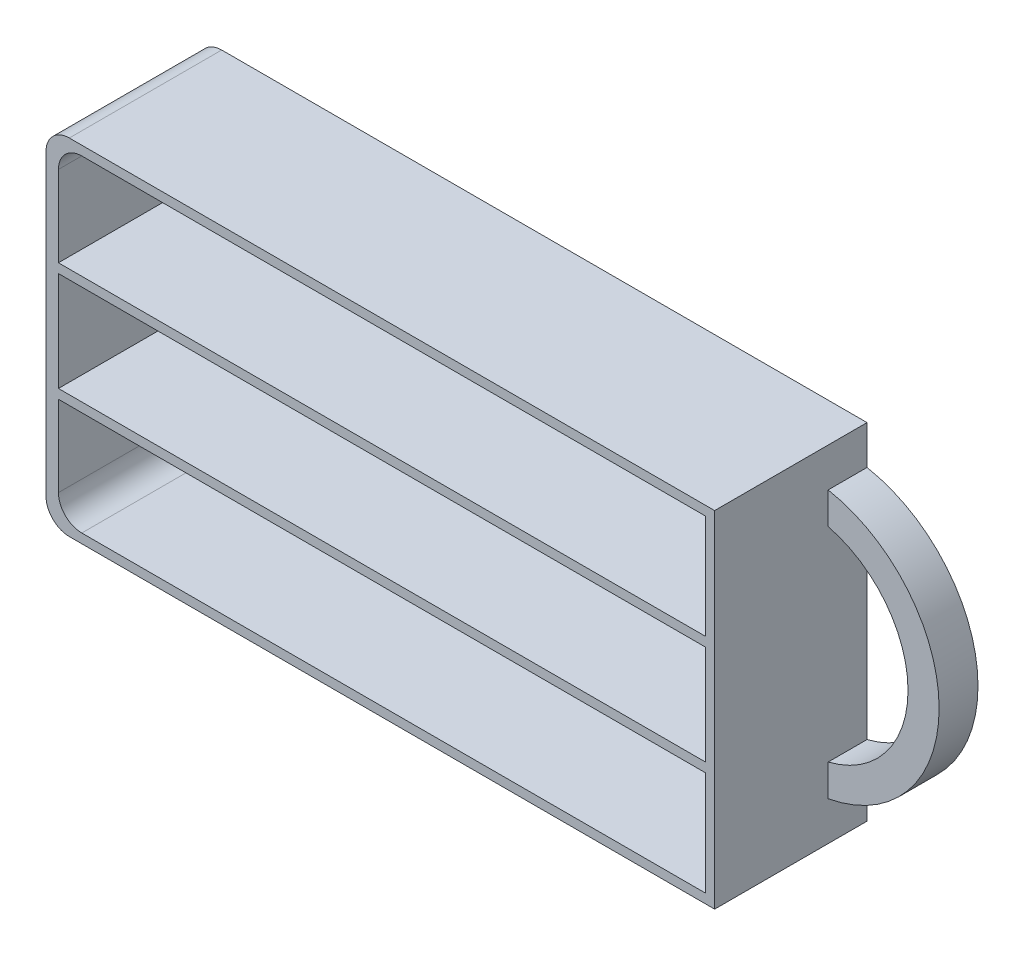
ISO-10303-21;
HEADER;
FILE_DESCRIPTION(('STEP AP214'),'2;1');
FILE_NAME('part.step','',(''),(''),'','','');
FILE_SCHEMA(('AUTOMOTIVE_DESIGN { 1 0 10303 214 1 1 1 1 }'));
ENDSEC;
DATA;
#1=APPLICATION_CONTEXT('core data for automotive mechanical design processes');
#2=APPLICATION_PROTOCOL_DEFINITION('international standard','automotive_design',2000,#1);
#3=PRODUCT_CONTEXT('',#1,'mechanical');
#4=PRODUCT('Part','Part','',(#3));
#5=PRODUCT_RELATED_PRODUCT_CATEGORY('part','',(#4));
#6=PRODUCT_DEFINITION_FORMATION('','',#4);
#7=PRODUCT_DEFINITION_CONTEXT('part definition',#1,'design');
#8=PRODUCT_DEFINITION('design','',#6,#7);
#9=PRODUCT_DEFINITION_SHAPE('','',#8);
#10=(LENGTH_UNIT() NAMED_UNIT(*) SI_UNIT(.MILLI.,.METRE.));
#11=(NAMED_UNIT(*) PLANE_ANGLE_UNIT() SI_UNIT($,.RADIAN.));
#12=(NAMED_UNIT(*) SI_UNIT($,.STERADIAN.) SOLID_ANGLE_UNIT());
#13=UNCERTAINTY_MEASURE_WITH_UNIT(LENGTH_MEASURE(1.E-05),#10,'distance_accuracy_value','');
#14=(GEOMETRIC_REPRESENTATION_CONTEXT(3) GLOBAL_UNCERTAINTY_ASSIGNED_CONTEXT((#13)) GLOBAL_UNIT_ASSIGNED_CONTEXT((#10,
#11,#12)) REPRESENTATION_CONTEXT('',''));
#15=CARTESIAN_POINT('',(0.,0.,0.));
#16=DIRECTION('',(0.,0.,1.));
#17=DIRECTION('',(1.,0.,0.));
#18=AXIS2_PLACEMENT_3D('',#15,#16,#17);
#19=CARTESIAN_POINT('',(0.,0.,19.6));
#20=DIRECTION('',(0.,0.,1.));
#21=DIRECTION('',(1.,0.,0.));
#22=AXIS2_PLACEMENT_3D('',#19,#20,#21);
#23=PLANE('',#22);
#24=DIRECTION('',(-1.,0.,0.));
#25=VECTOR('',#24,1.);
#26=CARTESIAN_POINT('',(0.,21.,19.6));
#27=LINE('',#26,#25);
#28=CARTESIAN_POINT('',(41.8,21.,19.6));
#29=VERTEX_POINT('',#28);
#30=CARTESIAN_POINT('',(-38.4,21.,19.6));
#31=VERTEX_POINT('',#30);
#32=EDGE_CURVE('E213',#29,#31,#27,.T.);
#33=ORIENTED_EDGE('',*,*,#32,.F.);
#34=DIRECTION('',(0.,1.,0.));
#35=VECTOR('',#34,1.);
#36=CARTESIAN_POINT('',(41.8,0.,19.6));
#37=LINE('',#36,#35);
#38=CARTESIAN_POINT('',(41.8,7.6,19.6));
#39=VERTEX_POINT('',#38);
#40=EDGE_CURVE('E223',#39,#29,#37,.T.);
#41=ORIENTED_EDGE('',*,*,#40,.F.);
#42=DIRECTION('',(-1.,0.,0.));
#43=VECTOR('',#42,1.);
#44=CARTESIAN_POINT('',(0.,7.6,19.6));
#45=LINE('',#44,#43);
#46=CARTESIAN_POINT('',(-41.4,7.6,19.6));
#47=VERTEX_POINT('',#46);
#48=EDGE_CURVE('E212',#39,#47,#45,.T.);
#49=ORIENTED_EDGE('',*,*,#48,.T.);
#50=DIRECTION('',(0.,-1.,0.));
#51=VECTOR('',#50,1.);
#52=CARTESIAN_POINT('',(-41.4,0.,19.6));
#53=LINE('',#52,#51);
#54=CARTESIAN_POINT('',(-41.4,18.,19.6));
#55=VERTEX_POINT('',#54);
#56=EDGE_CURVE('E204',#55,#47,#53,.T.);
#57=ORIENTED_EDGE('',*,*,#56,.F.);
#58=CARTESIAN_POINT('',(-38.4,18.,19.6));
#59=DIRECTION('',(0.,0.,1.));
#60=DIRECTION('',(1.,0.,0.));
#61=AXIS2_PLACEMENT_3D('',#58,#59,#60);
#62=CIRCLE('',#61,3.);
#63=EDGE_CURVE('E12',#55,#31,#62,.F.);
#64=ORIENTED_EDGE('',*,*,#63,.T.);
#65=EDGE_LOOP('',(#33,#41,#49,#57,#64));
#66=FACE_BOUND('',#65,.T.);
#67=DIRECTION('',(0.,1.,0.));
#68=VECTOR('',#67,1.);
#69=CARTESIAN_POINT('',(41.8,0.,19.6));
#70=LINE('',#69,#68);
#71=CARTESIAN_POINT('',(41.8,-21.,19.6));
#72=VERTEX_POINT('',#71);
#73=CARTESIAN_POINT('',(41.8,-7.6,19.6));
#74=VERTEX_POINT('',#73);
#75=EDGE_CURVE('E278',#72,#74,#70,.T.);
#76=ORIENTED_EDGE('',*,*,#75,.F.);
#77=DIRECTION('',(1.,0.,0.));
#78=VECTOR('',#77,1.);
#79=CARTESIAN_POINT('',(0.,-21.,19.6));
#80=LINE('',#79,#78);
#81=CARTESIAN_POINT('',(-38.4,-21.,19.6));
#82=VERTEX_POINT('',#81);
#83=EDGE_CURVE('E286',#82,#72,#80,.T.);
#84=ORIENTED_EDGE('',*,*,#83,.F.);
#85=CARTESIAN_POINT('',(-38.4,-18.,19.6));
#86=DIRECTION('',(0.,0.,1.));
#87=DIRECTION('',(1.,0.,0.));
#88=AXIS2_PLACEMENT_3D('',#85,#86,#87);
#89=CIRCLE('',#88,3.);
#90=CARTESIAN_POINT('',(-41.4,-18.,19.6));
#91=VERTEX_POINT('',#90);
#92=EDGE_CURVE('E49',#82,#91,#89,.F.);
#93=ORIENTED_EDGE('',*,*,#92,.T.);
#94=DIRECTION('',(0.,-1.,0.));
#95=VECTOR('',#94,1.);
#96=CARTESIAN_POINT('',(-41.4,0.,19.6));
#97=LINE('',#96,#95);
#98=CARTESIAN_POINT('',(-41.4,-7.6,19.6));
#99=VERTEX_POINT('',#98);
#100=EDGE_CURVE('E283',#99,#91,#97,.T.);
#101=ORIENTED_EDGE('',*,*,#100,.F.);
#102=DIRECTION('',(-1.,0.,0.));
#103=VECTOR('',#102,1.);
#104=CARTESIAN_POINT('',(0.,-7.6,19.6));
#105=LINE('',#104,#103);
#106=EDGE_CURVE('E280',#74,#99,#105,.T.);
#107=ORIENTED_EDGE('',*,*,#106,.F.);
#108=EDGE_LOOP('',(#76,#84,#93,#101,#107));
#109=FACE_BOUND('',#108,.T.);
#110=DIRECTION('',(-1.,0.,0.));
#111=VECTOR('',#110,1.);
#112=CARTESIAN_POINT('',(-43.,22.2,19.6));
#113=LINE('',#112,#111);
#114=CARTESIAN_POINT('',(43.,22.2,19.6));
#115=VERTEX_POINT('',#114);
#116=CARTESIAN_POINT('',(-40.,22.2,19.6));
#117=VERTEX_POINT('',#116);
#118=EDGE_CURVE('E329',#115,#117,#113,.T.);
#119=ORIENTED_EDGE('',*,*,#118,.T.);
#120=CARTESIAN_POINT('',(-40.,19.2,19.6));
#121=DIRECTION('',(0.,0.,1.));
#122=DIRECTION('',(1.,0.,0.));
#123=AXIS2_PLACEMENT_3D('',#120,#121,#122);
#124=CIRCLE('',#123,3.);
#125=CARTESIAN_POINT('',(-43.,19.2,19.6));
#126=VERTEX_POINT('',#125);
#127=EDGE_CURVE('E367',#117,#126,#124,.T.);
#128=ORIENTED_EDGE('',*,*,#127,.T.);
#129=DIRECTION('',(0.,-1.,0.));
#130=VECTOR('',#129,1.);
#131=CARTESIAN_POINT('',(-43.,22.2,19.6));
#132=LINE('',#131,#130);
#133=CARTESIAN_POINT('',(-43.,-19.2,19.6));
#134=VERTEX_POINT('',#133);
#135=EDGE_CURVE('E333',#126,#134,#132,.T.);
#136=ORIENTED_EDGE('',*,*,#135,.T.);
#137=CARTESIAN_POINT('',(-40.,-19.2,19.6));
#138=DIRECTION('',(0.,0.,1.));
#139=DIRECTION('',(1.,0.,0.));
#140=AXIS2_PLACEMENT_3D('',#137,#138,#139);
#141=CIRCLE('',#140,3.);
#142=CARTESIAN_POINT('',(-40.,-22.2,19.6));
#143=VERTEX_POINT('',#142);
#144=EDGE_CURVE('E365',#134,#143,#141,.T.);
#145=ORIENTED_EDGE('',*,*,#144,.T.);
#146=DIRECTION('',(1.,0.,0.));
#147=VECTOR('',#146,1.);
#148=CARTESIAN_POINT('',(-43.,-22.2,19.6));
#149=LINE('',#148,#147);
#150=CARTESIAN_POINT('',(43.,-22.2,19.6));
#151=VERTEX_POINT('',#150);
#152=EDGE_CURVE('E336',#143,#151,#149,.T.);
#153=ORIENTED_EDGE('',*,*,#152,.T.);
#154=DIRECTION('',(0.,1.,0.));
#155=VECTOR('',#154,1.);
#156=CARTESIAN_POINT('',(43.,22.2,19.6));
#157=LINE('',#156,#155);
#158=EDGE_CURVE('E326',#151,#115,#157,.T.);
#159=ORIENTED_EDGE('',*,*,#158,.T.);
#160=EDGE_LOOP('',(#119,#128,#136,#145,#153,#159));
#161=FACE_BOUND('',#160,.T.);
#162=DIRECTION('',(0.,1.,0.));
#163=VECTOR('',#162,1.);
#164=CARTESIAN_POINT('',(41.8,0.,19.6));
#165=LINE('',#164,#163);
#166=CARTESIAN_POINT('',(41.8,-6.4,19.6));
#167=VERTEX_POINT('',#166);
#168=CARTESIAN_POINT('',(41.8,6.4,19.6));
#169=VERTEX_POINT('',#168);
#170=EDGE_CURVE('E251',#167,#169,#165,.T.);
#171=ORIENTED_EDGE('',*,*,#170,.F.);
#172=DIRECTION('',(-1.,0.,0.));
#173=VECTOR('',#172,1.);
#174=CARTESIAN_POINT('',(0.,-6.4,19.6));
#175=LINE('',#174,#173);
#176=CARTESIAN_POINT('',(-41.4,-6.4,19.6));
#177=VERTEX_POINT('',#176);
#178=EDGE_CURVE('E248',#167,#177,#175,.T.);
#179=ORIENTED_EDGE('',*,*,#178,.T.);
#180=DIRECTION('',(0.,-1.,0.));
#181=VECTOR('',#180,1.);
#182=CARTESIAN_POINT('',(-41.4,0.,19.6));
#183=LINE('',#182,#181);
#184=CARTESIAN_POINT('',(-41.4,6.4,19.6));
#185=VERTEX_POINT('',#184);
#186=EDGE_CURVE('E258',#185,#177,#183,.T.);
#187=ORIENTED_EDGE('',*,*,#186,.F.);
#188=DIRECTION('',(-1.,0.,0.));
#189=VECTOR('',#188,1.);
#190=CARTESIAN_POINT('',(0.,6.4,19.6));
#191=LINE('',#190,#189);
#192=EDGE_CURVE('E255',#169,#185,#191,.T.);
#193=ORIENTED_EDGE('',*,*,#192,.F.);
#194=EDGE_LOOP('',(#171,#179,#187,#193));
#195=FACE_BOUND('',#194,.T.);
#196=ADVANCED_FACE('F41',(#66,#109,#161,#195),#23,.T.);
#197=CARTESIAN_POINT('',(43.,22.2,19.6));
#198=DIRECTION('',(-1.,0.,0.));
#199=DIRECTION('',(0.,-1.,0.));
#200=AXIS2_PLACEMENT_3D('',#197,#198,#199);
#201=PLANE('',#200);
#202=DIRECTION('',(0.,0.,-1.));
#203=VECTOR('',#202,1.);
#204=CARTESIAN_POINT('',(43.,-17.2,5.));
#205=LINE('',#204,#203);
#206=CARTESIAN_POINT('',(43.,-17.2,5.));
#207=VERTEX_POINT('',#206);
#208=CARTESIAN_POINT('',(43.,-17.2,0.));
#209=VERTEX_POINT('',#208);
#210=EDGE_CURVE('E309',#207,#209,#205,.T.);
#211=ORIENTED_EDGE('',*,*,#210,.F.);
#212=DIRECTION('',(0.,-1.,0.));
#213=VECTOR('',#212,1.);
#214=CARTESIAN_POINT('',(43.,-17.2,5.));
#215=LINE('',#214,#213);
#216=CARTESIAN_POINT('',(43.,-13.1087756865391,5.));
#217=VERTEX_POINT('',#216);
#218=EDGE_CURVE('E306',#217,#207,#215,.T.);
#219=ORIENTED_EDGE('',*,*,#218,.F.);
#220=DIRECTION('',(0.,0.,-1.));
#221=VECTOR('',#220,1.);
#222=CARTESIAN_POINT('',(43.,-13.1087756865391,5.));
#223=LINE('',#222,#221);
#224=CARTESIAN_POINT('',(43.,-13.1087756865391,0.));
#225=VERTEX_POINT('',#224);
#226=EDGE_CURVE('E316',#217,#225,#223,.T.);
#227=ORIENTED_EDGE('',*,*,#226,.T.);
#228=DIRECTION('',(0.,1.,0.));
#229=VECTOR('',#228,1.);
#230=CARTESIAN_POINT('',(43.,22.2,0.));
#231=LINE('',#230,#229);
#232=CARTESIAN_POINT('',(43.,13.1087756865391,0.));
#233=VERTEX_POINT('',#232);
#234=EDGE_CURVE('E342',#225,#233,#231,.T.);
#235=ORIENTED_EDGE('',*,*,#234,.T.);
#236=DIRECTION('',(0.,0.,-1.));
#237=VECTOR('',#236,1.);
#238=CARTESIAN_POINT('',(43.,13.1087756865391,5.));
#239=LINE('',#238,#237);
#240=CARTESIAN_POINT('',(43.,13.1087756865391,5.));
#241=VERTEX_POINT('',#240);
#242=EDGE_CURVE('E319',#241,#233,#239,.T.);
#243=ORIENTED_EDGE('',*,*,#242,.F.);
#244=DIRECTION('',(0.,-1.,0.));
#245=VECTOR('',#244,1.);
#246=CARTESIAN_POINT('',(43.,17.2,5.));
#247=LINE('',#246,#245);
#248=CARTESIAN_POINT('',(43.,17.2,5.));
#249=VERTEX_POINT('',#248);
#250=EDGE_CURVE('E299',#249,#241,#247,.T.);
#251=ORIENTED_EDGE('',*,*,#250,.F.);
#252=DIRECTION('',(0.,0.,-1.));
#253=VECTOR('',#252,1.);
#254=CARTESIAN_POINT('',(43.,17.2,5.));
#255=LINE('',#254,#253);
#256=CARTESIAN_POINT('',(43.,17.2,0.));
#257=VERTEX_POINT('',#256);
#258=EDGE_CURVE('E322',#249,#257,#255,.T.);
#259=ORIENTED_EDGE('',*,*,#258,.T.);
#260=CARTESIAN_POINT('',(43.,22.2,0.));
#261=VERTEX_POINT('',#260);
#262=EDGE_CURVE('E325',#257,#261,#231,.T.);
#263=ORIENTED_EDGE('',*,*,#262,.T.);
#264=DIRECTION('',(0.,0.,-1.));
#265=VECTOR('',#264,1.);
#266=CARTESIAN_POINT('',(43.,22.2,19.6));
#267=LINE('',#266,#265);
#268=EDGE_CURVE('E351',#115,#261,#267,.T.);
#269=ORIENTED_EDGE('',*,*,#268,.F.);
#270=ORIENTED_EDGE('',*,*,#158,.F.);
#271=DIRECTION('',(0.,0.,-1.));
#272=VECTOR('',#271,1.);
#273=CARTESIAN_POINT('',(43.,-22.2,19.6));
#274=LINE('',#273,#272);
#275=CARTESIAN_POINT('',(43.,-22.2,0.));
#276=VERTEX_POINT('',#275);
#277=EDGE_CURVE('E338',#151,#276,#274,.T.);
#278=ORIENTED_EDGE('',*,*,#277,.T.);
#279=EDGE_CURVE('E339',#276,#209,#231,.T.);
#280=ORIENTED_EDGE('',*,*,#279,.T.);
#281=EDGE_LOOP('',(#211,#219,#227,#235,#243,#251,#259,#263,#269,#270,#278,#280));
#282=FACE_BOUND('',#281,.T.);
#283=ADVANCED_FACE('F419',(#282),#201,.F.);
#284=CARTESIAN_POINT('',(-43.,22.2,19.6));
#285=DIRECTION('',(0.,-1.,0.));
#286=DIRECTION('',(0.,0.,-1.));
#287=AXIS2_PLACEMENT_3D('',#284,#285,#286);
#288=PLANE('',#287);
#289=DIRECTION('',(-1.,0.,0.));
#290=VECTOR('',#289,1.);
#291=CARTESIAN_POINT('',(-43.,22.2,0.));
#292=LINE('',#291,#290);
#293=CARTESIAN_POINT('',(-40.,22.2,0.));
#294=VERTEX_POINT('',#293);
#295=EDGE_CURVE('E341',#261,#294,#292,.T.);
#296=ORIENTED_EDGE('',*,*,#295,.T.);
#297=DIRECTION('',(0.,0.,-1.));
#298=VECTOR('',#297,1.);
#299=CARTESIAN_POINT('',(-40.,22.2,19.6));
#300=LINE('',#299,#298);
#301=EDGE_CURVE('E363',#294,#117,#300,.F.);
#302=ORIENTED_EDGE('',*,*,#301,.T.);
#303=ORIENTED_EDGE('',*,*,#118,.F.);
#304=ORIENTED_EDGE('',*,*,#268,.T.);
#305=EDGE_LOOP('',(#296,#302,#303,#304));
#306=FACE_BOUND('',#305,.T.);
#307=ADVANCED_FACE('F424',(#306),#288,.F.);
#308=CARTESIAN_POINT('',(-43.,22.2,19.6));
#309=DIRECTION('',(1.,0.,0.));
#310=DIRECTION('',(0.,1.,0.));
#311=AXIS2_PLACEMENT_3D('',#308,#309,#310);
#312=PLANE('',#311);
#313=ORIENTED_EDGE('',*,*,#135,.F.);
#314=DIRECTION('',(0.,0.,-1.));
#315=VECTOR('',#314,1.);
#316=CARTESIAN_POINT('',(-43.,19.2,19.6));
#317=LINE('',#316,#315);
#318=CARTESIAN_POINT('',(-43.,19.2,0.));
#319=VERTEX_POINT('',#318);
#320=EDGE_CURVE('E356',#126,#319,#317,.T.);
#321=ORIENTED_EDGE('',*,*,#320,.T.);
#322=DIRECTION('',(0.,-1.,0.));
#323=VECTOR('',#322,1.);
#324=CARTESIAN_POINT('',(-43.,22.2,0.));
#325=LINE('',#324,#323);
#326=CARTESIAN_POINT('',(-43.,-19.2,0.));
#327=VERTEX_POINT('',#326);
#328=EDGE_CURVE('E345',#319,#327,#325,.T.);
#329=ORIENTED_EDGE('',*,*,#328,.T.);
#330=DIRECTION('',(0.,0.,-1.));
#331=VECTOR('',#330,1.);
#332=CARTESIAN_POINT('',(-43.,-19.2,19.6));
#333=LINE('',#332,#331);
#334=EDGE_CURVE('E354',#327,#134,#333,.F.);
#335=ORIENTED_EDGE('',*,*,#334,.T.);
#336=EDGE_LOOP('',(#313,#321,#329,#335));
#337=FACE_BOUND('',#336,.T.);
#338=ADVANCED_FACE('F438',(#337),#312,.F.);
#339=CARTESIAN_POINT('',(-43.,-22.2,19.6));
#340=DIRECTION('',(0.,1.,0.));
#341=DIRECTION('',(0.,0.,1.));
#342=AXIS2_PLACEMENT_3D('',#339,#340,#341);
#343=PLANE('',#342);
#344=ORIENTED_EDGE('',*,*,#152,.F.);
#345=DIRECTION('',(0.,0.,-1.));
#346=VECTOR('',#345,1.);
#347=CARTESIAN_POINT('',(-40.,-22.2,19.6));
#348=LINE('',#347,#346);
#349=CARTESIAN_POINT('',(-40.,-22.2,0.));
#350=VERTEX_POINT('',#349);
#351=EDGE_CURVE('E369',#143,#350,#348,.T.);
#352=ORIENTED_EDGE('',*,*,#351,.T.);
#353=DIRECTION('',(1.,0.,0.));
#354=VECTOR('',#353,1.);
#355=CARTESIAN_POINT('',(-43.,-22.2,0.));
#356=LINE('',#355,#354);
#357=EDGE_CURVE('E330',#350,#276,#356,.T.);
#358=ORIENTED_EDGE('',*,*,#357,.T.);
#359=ORIENTED_EDGE('',*,*,#277,.F.);
#360=EDGE_LOOP('',(#344,#352,#358,#359));
#361=FACE_BOUND('',#360,.T.);
#362=ADVANCED_FACE('F434',(#361),#343,.F.);
#363=CARTESIAN_POINT('',(0.,0.,0.));
#364=DIRECTION('',(0.,0.,1.));
#365=DIRECTION('',(1.,0.,0.));
#366=AXIS2_PLACEMENT_3D('',#363,#364,#365);
#367=PLANE('',#366);
#368=CARTESIAN_POINT('',(39.7735468390197,0.,0.));
#369=DIRECTION('',(0.,0.,-1.));
#370=DIRECTION('',(1.,0.,0.));
#371=AXIS2_PLACEMENT_3D('',#368,#369,#370);
#372=CIRCLE('',#371,13.5);
#373=EDGE_CURVE('E300',#233,#225,#372,.T.);
#374=ORIENTED_EDGE('',*,*,#373,.F.);
#375=ORIENTED_EDGE('',*,*,#234,.F.);
#376=EDGE_LOOP('',(#374,#375));
#377=FACE_BOUND('',#376,.T.);
#378=ORIENTED_EDGE('',*,*,#328,.F.);
#379=CARTESIAN_POINT('',(-40.,19.2,0.));
#380=DIRECTION('',(0.,0.,1.));
#381=DIRECTION('',(1.,0.,0.));
#382=AXIS2_PLACEMENT_3D('',#379,#380,#381);
#383=CIRCLE('',#382,3.);
#384=EDGE_CURVE('E361',#319,#294,#383,.F.);
#385=ORIENTED_EDGE('',*,*,#384,.T.);
#386=ORIENTED_EDGE('',*,*,#295,.F.);
#387=ORIENTED_EDGE('',*,*,#262,.F.);
#388=CARTESIAN_POINT('',(39.7735468390197,0.,0.));
#389=DIRECTION('',(0.,0.,1.));
#390=DIRECTION('',(1.,0.,0.));
#391=AXIS2_PLACEMENT_3D('',#388,#389,#390);
#392=CIRCLE('',#391,17.5);
#393=EDGE_CURVE('E237',#209,#257,#392,.T.);
#394=ORIENTED_EDGE('',*,*,#393,.F.);
#395=ORIENTED_EDGE('',*,*,#279,.F.);
#396=ORIENTED_EDGE('',*,*,#357,.F.);
#397=CARTESIAN_POINT('',(-40.,-19.2,0.));
#398=DIRECTION('',(0.,0.,1.));
#399=DIRECTION('',(1.,0.,0.));
#400=AXIS2_PLACEMENT_3D('',#397,#398,#399);
#401=CIRCLE('',#400,3.);
#402=EDGE_CURVE('E359',#350,#327,#401,.F.);
#403=ORIENTED_EDGE('',*,*,#402,.T.);
#404=EDGE_LOOP('',(#378,#385,#386,#387,#394,#395,#396,#403));
#405=FACE_BOUND('',#404,.T.);
#406=ADVANCED_FACE('F431',(#377,#405),#367,.F.);
#407=CARTESIAN_POINT('',(39.7735468390197,0.,5.));
#408=DIRECTION('',(0.,0.,-1.));
#409=DIRECTION('',(-1.,0.,0.));
#410=AXIS2_PLACEMENT_3D('',#407,#408,#409);
#411=CYLINDRICAL_SURFACE('',#410,17.5);
#412=ORIENTED_EDGE('',*,*,#393,.T.);
#413=ORIENTED_EDGE('',*,*,#258,.F.);
#414=CARTESIAN_POINT('',(39.7735468390197,0.,5.));
#415=DIRECTION('',(0.,0.,1.));
#416=DIRECTION('',(1.,0.,0.));
#417=AXIS2_PLACEMENT_3D('',#414,#415,#416);
#418=CIRCLE('',#417,17.5);
#419=EDGE_CURVE('E296',#207,#249,#418,.T.);
#420=ORIENTED_EDGE('',*,*,#419,.F.);
#421=ORIENTED_EDGE('',*,*,#210,.T.);
#422=EDGE_LOOP('',(#412,#413,#420,#421));
#423=FACE_BOUND('',#422,.T.);
#424=ADVANCED_FACE('F429',(#423),#411,.T.);
#425=CARTESIAN_POINT('',(39.7735468390197,0.,5.));
#426=DIRECTION('',(0.,0.,-1.));
#427=DIRECTION('',(-1.,0.,0.));
#428=AXIS2_PLACEMENT_3D('',#425,#426,#427);
#429=CYLINDRICAL_SURFACE('',#428,13.5);
#430=ORIENTED_EDGE('',*,*,#373,.T.);
#431=ORIENTED_EDGE('',*,*,#226,.F.);
#432=CARTESIAN_POINT('',(39.7735468390197,0.,5.));
#433=DIRECTION('',(0.,0.,-1.));
#434=DIRECTION('',(1.,0.,0.));
#435=AXIS2_PLACEMENT_3D('',#432,#433,#434);
#436=CIRCLE('',#435,13.5);
#437=EDGE_CURVE('E303',#241,#217,#436,.T.);
#438=ORIENTED_EDGE('',*,*,#437,.F.);
#439=ORIENTED_EDGE('',*,*,#242,.T.);
#440=EDGE_LOOP('',(#430,#431,#438,#439));
#441=FACE_BOUND('',#440,.T.);
#442=ADVANCED_FACE('F509',(#441),#429,.F.);
#443=CARTESIAN_POINT('',(39.7735468390197,0.,5.));
#444=DIRECTION('',(0.,0.,1.));
#445=DIRECTION('',(1.,0.,0.));
#446=AXIS2_PLACEMENT_3D('',#443,#444,#445);
#447=PLANE('',#446);
#448=ORIENTED_EDGE('',*,*,#419,.T.);
#449=ORIENTED_EDGE('',*,*,#250,.T.);
#450=ORIENTED_EDGE('',*,*,#437,.T.);
#451=ORIENTED_EDGE('',*,*,#218,.T.);
#452=EDGE_LOOP('',(#448,#449,#450,#451));
#453=FACE_BOUND('',#452,.T.);
#454=ADVANCED_FACE('F505',(#453),#447,.T.);
#455=CARTESIAN_POINT('',(41.8,0.,-84.2721780898061));
#456=DIRECTION('',(1.,0.,0.));
#457=DIRECTION('',(0.,1.,0.));
#458=AXIS2_PLACEMENT_3D('',#455,#456,#457);
#459=PLANE('',#458);
#460=DIRECTION('',(0.,-1.,0.));
#461=VECTOR('',#460,1.);
#462=CARTESIAN_POINT('',(41.8,0.,1.20000000000001));
#463=LINE('',#462,#461);
#464=CARTESIAN_POINT('',(41.8,-7.6,1.20000000000001));
#465=VERTEX_POINT('',#464);
#466=CARTESIAN_POINT('',(41.8,-21.,1.20000000000001));
#467=VERTEX_POINT('',#466);
#468=EDGE_CURVE('E276',#465,#467,#463,.T.);
#469=ORIENTED_EDGE('',*,*,#468,.T.);
#470=DIRECTION('',(0.,0.,1.));
#471=VECTOR('',#470,1.);
#472=CARTESIAN_POINT('',(41.8,-21.,-84.2721780898061));
#473=LINE('',#472,#471);
#474=EDGE_CURVE('E273',#467,#72,#473,.T.);
#475=ORIENTED_EDGE('',*,*,#474,.T.);
#476=ORIENTED_EDGE('',*,*,#75,.T.);
#477=DIRECTION('',(0.,0.,1.));
#478=VECTOR('',#477,1.);
#479=CARTESIAN_POINT('',(41.8,-7.6,-84.2721780898061));
#480=LINE('',#479,#478);
#481=EDGE_CURVE('E288',#465,#74,#480,.T.);
#482=ORIENTED_EDGE('',*,*,#481,.F.);
#483=EDGE_LOOP('',(#469,#475,#476,#482));
#484=FACE_BOUND('',#483,.T.);
#485=ADVANCED_FACE('F404',(#484),#459,.F.);
#486=CARTESIAN_POINT('',(0.,-21.,-84.2721780898061));
#487=DIRECTION('',(0.,-1.,0.));
#488=DIRECTION('',(0.,0.,-1.));
#489=AXIS2_PLACEMENT_3D('',#486,#487,#488);
#490=PLANE('',#489);
#491=DIRECTION('',(-1.,0.,0.));
#492=VECTOR('',#491,1.);
#493=CARTESIAN_POINT('',(0.,-21.,1.20000000000001));
#494=LINE('',#493,#492);
#495=CARTESIAN_POINT('',(-38.4,-21.,1.20000000000001));
#496=VERTEX_POINT('',#495);
#497=EDGE_CURVE('E272',#467,#496,#494,.T.);
#498=ORIENTED_EDGE('',*,*,#497,.T.);
#499=DIRECTION('',(0.,0.,1.));
#500=VECTOR('',#499,1.);
#501=CARTESIAN_POINT('',(-38.4,-21.,19.6));
#502=LINE('',#501,#500);
#503=EDGE_CURVE('E372',#496,#82,#502,.T.);
#504=ORIENTED_EDGE('',*,*,#503,.T.);
#505=ORIENTED_EDGE('',*,*,#83,.T.);
#506=ORIENTED_EDGE('',*,*,#474,.F.);
#507=EDGE_LOOP('',(#498,#504,#505,#506));
#508=FACE_BOUND('',#507,.T.);
#509=ADVANCED_FACE('F402',(#508),#490,.F.);
#510=CARTESIAN_POINT('',(-41.4,0.,-84.2721780898061));
#511=DIRECTION('',(-1.,0.,0.));
#512=DIRECTION('',(0.,-1.,0.));
#513=AXIS2_PLACEMENT_3D('',#510,#511,#512);
#514=PLANE('',#513);
#515=ORIENTED_EDGE('',*,*,#100,.T.);
#516=DIRECTION('',(0.,0.,1.));
#517=VECTOR('',#516,1.);
#518=CARTESIAN_POINT('',(-41.4,-18.,1.20000000000001));
#519=LINE('',#518,#517);
#520=CARTESIAN_POINT('',(-41.4,-18.,1.20000000000001));
#521=VERTEX_POINT('',#520);
#522=EDGE_CURVE('E375',#91,#521,#519,.F.);
#523=ORIENTED_EDGE('',*,*,#522,.T.);
#524=DIRECTION('',(0.,1.,0.));
#525=VECTOR('',#524,1.);
#526=CARTESIAN_POINT('',(-41.4,0.,1.20000000000001));
#527=LINE('',#526,#525);
#528=CARTESIAN_POINT('',(-41.4,-7.6,1.20000000000001));
#529=VERTEX_POINT('',#528);
#530=EDGE_CURVE('E270',#521,#529,#527,.T.);
#531=ORIENTED_EDGE('',*,*,#530,.T.);
#532=DIRECTION('',(0.,0.,1.));
#533=VECTOR('',#532,1.);
#534=CARTESIAN_POINT('',(-41.4,-7.6,-84.2721780898061));
#535=LINE('',#534,#533);
#536=EDGE_CURVE('E291',#529,#99,#535,.T.);
#537=ORIENTED_EDGE('',*,*,#536,.T.);
#538=EDGE_LOOP('',(#515,#523,#531,#537));
#539=FACE_BOUND('',#538,.T.);
#540=ADVANCED_FACE('F390',(#539),#514,.F.);
#541=CARTESIAN_POINT('',(0.,-7.6,-84.2721780898061));
#542=DIRECTION('',(0.,1.,0.));
#543=DIRECTION('',(0.,0.,1.));
#544=AXIS2_PLACEMENT_3D('',#541,#542,#543);
#545=PLANE('',#544);
#546=DIRECTION('',(1.,0.,0.));
#547=VECTOR('',#546,1.);
#548=CARTESIAN_POINT('',(0.,-7.6,1.20000000000001));
#549=LINE('',#548,#547);
#550=EDGE_CURVE('E252',#529,#465,#549,.T.);
#551=ORIENTED_EDGE('',*,*,#550,.T.);
#552=ORIENTED_EDGE('',*,*,#481,.T.);
#553=ORIENTED_EDGE('',*,*,#106,.T.);
#554=ORIENTED_EDGE('',*,*,#536,.F.);
#555=EDGE_LOOP('',(#551,#552,#553,#554));
#556=FACE_BOUND('',#555,.T.);
#557=ADVANCED_FACE('F407',(#556),#545,.F.);
#558=CARTESIAN_POINT('',(0.,0.,1.2));
#559=DIRECTION('',(0.,0.,1.));
#560=DIRECTION('',(1.,0.,0.));
#561=AXIS2_PLACEMENT_3D('',#558,#559,#560);
#562=PLANE('',#561);
#563=ORIENTED_EDGE('',*,*,#530,.F.);
#564=CARTESIAN_POINT('',(-38.4,-18.,1.20000000000001));
#565=DIRECTION('',(0.,0.,1.));
#566=DIRECTION('',(1.,0.,0.));
#567=AXIS2_PLACEMENT_3D('',#564,#565,#566);
#568=CIRCLE('',#567,3.);
#569=EDGE_CURVE('E377',#521,#496,#568,.T.);
#570=ORIENTED_EDGE('',*,*,#569,.T.);
#571=ORIENTED_EDGE('',*,*,#497,.F.);
#572=ORIENTED_EDGE('',*,*,#468,.F.);
#573=ORIENTED_EDGE('',*,*,#550,.F.);
#574=EDGE_LOOP('',(#563,#570,#571,#572,#573));
#575=FACE_BOUND('',#574,.T.);
#576=ADVANCED_FACE('F397',(#575),#562,.T.);
#577=CARTESIAN_POINT('',(0.,-6.4,-84.2721780898061));
#578=DIRECTION('',(0.,1.,0.));
#579=DIRECTION('',(0.,0.,1.));
#580=AXIS2_PLACEMENT_3D('',#577,#578,#579);
#581=PLANE('',#580);
#582=DIRECTION('',(0.,0.,1.));
#583=VECTOR('',#582,1.);
#584=CARTESIAN_POINT('',(-41.4,-6.4,-84.2721780898061));
#585=LINE('',#584,#583);
#586=CARTESIAN_POINT('',(-41.4,-6.4,1.20000000000001));
#587=VERTEX_POINT('',#586);
#588=EDGE_CURVE('E242',#587,#177,#585,.T.);
#589=ORIENTED_EDGE('',*,*,#588,.T.);
#590=ORIENTED_EDGE('',*,*,#178,.F.);
#591=DIRECTION('',(0.,0.,1.));
#592=VECTOR('',#591,1.);
#593=CARTESIAN_POINT('',(41.8,-6.4,-84.2721780898061));
#594=LINE('',#593,#592);
#595=CARTESIAN_POINT('',(41.8,-6.4,1.20000000000001));
#596=VERTEX_POINT('',#595);
#597=EDGE_CURVE('E261',#596,#167,#594,.T.);
#598=ORIENTED_EDGE('',*,*,#597,.F.);
#599=DIRECTION('',(1.,0.,0.));
#600=VECTOR('',#599,1.);
#601=CARTESIAN_POINT('',(0.,-6.4,1.20000000000001));
#602=LINE('',#601,#600);
#603=EDGE_CURVE('E244',#587,#596,#602,.T.);
#604=ORIENTED_EDGE('',*,*,#603,.F.);
#605=EDGE_LOOP('',(#589,#590,#598,#604));
#606=FACE_BOUND('',#605,.T.);
#607=ADVANCED_FACE('F414',(#606),#581,.T.);
#608=CARTESIAN_POINT('',(-41.4,0.,-84.2721780898061));
#609=DIRECTION('',(-1.,0.,0.));
#610=DIRECTION('',(0.,-1.,0.));
#611=AXIS2_PLACEMENT_3D('',#608,#609,#610);
#612=PLANE('',#611);
#613=DIRECTION('',(0.,1.,0.));
#614=VECTOR('',#613,1.);
#615=CARTESIAN_POINT('',(-41.4,0.,1.20000000000001));
#616=LINE('',#615,#614);
#617=CARTESIAN_POINT('',(-41.4,6.4,1.20000000000001));
#618=VERTEX_POINT('',#617);
#619=EDGE_CURVE('E241',#587,#618,#616,.T.);
#620=ORIENTED_EDGE('',*,*,#619,.T.);
#621=DIRECTION('',(0.,0.,1.));
#622=VECTOR('',#621,1.);
#623=CARTESIAN_POINT('',(-41.4,6.4,-84.2721780898061));
#624=LINE('',#623,#622);
#625=EDGE_CURVE('E263',#618,#185,#624,.T.);
#626=ORIENTED_EDGE('',*,*,#625,.T.);
#627=ORIENTED_EDGE('',*,*,#186,.T.);
#628=ORIENTED_EDGE('',*,*,#588,.F.);
#629=EDGE_LOOP('',(#620,#626,#627,#628));
#630=FACE_BOUND('',#629,.T.);
#631=ADVANCED_FACE('F487',(#630),#612,.F.);
#632=CARTESIAN_POINT('',(0.,6.4,-84.2721780898061));
#633=DIRECTION('',(0.,1.,0.));
#634=DIRECTION('',(0.,0.,1.));
#635=AXIS2_PLACEMENT_3D('',#632,#633,#634);
#636=PLANE('',#635);
#637=DIRECTION('',(1.,0.,0.));
#638=VECTOR('',#637,1.);
#639=CARTESIAN_POINT('',(0.,6.4,1.20000000000001));
#640=LINE('',#639,#638);
#641=CARTESIAN_POINT('',(41.8,6.4,1.20000000000001));
#642=VERTEX_POINT('',#641);
#643=EDGE_CURVE('E239',#618,#642,#640,.T.);
#644=ORIENTED_EDGE('',*,*,#643,.T.);
#645=DIRECTION('',(0.,0.,1.));
#646=VECTOR('',#645,1.);
#647=CARTESIAN_POINT('',(41.8,6.4,-84.2721780898061));
#648=LINE('',#647,#646);
#649=EDGE_CURVE('E265',#642,#169,#648,.T.);
#650=ORIENTED_EDGE('',*,*,#649,.T.);
#651=ORIENTED_EDGE('',*,*,#192,.T.);
#652=ORIENTED_EDGE('',*,*,#625,.F.);
#653=EDGE_LOOP('',(#644,#650,#651,#652));
#654=FACE_BOUND('',#653,.T.);
#655=ADVANCED_FACE('F490',(#654),#636,.F.);
#656=CARTESIAN_POINT('',(41.8,0.,-84.2721780898061));
#657=DIRECTION('',(1.,0.,0.));
#658=DIRECTION('',(0.,1.,0.));
#659=AXIS2_PLACEMENT_3D('',#656,#657,#658);
#660=PLANE('',#659);
#661=DIRECTION('',(0.,-1.,0.));
#662=VECTOR('',#661,1.);
#663=CARTESIAN_POINT('',(41.8,0.,1.20000000000001));
#664=LINE('',#663,#662);
#665=EDGE_CURVE('E247',#642,#596,#664,.T.);
#666=ORIENTED_EDGE('',*,*,#665,.T.);
#667=ORIENTED_EDGE('',*,*,#597,.T.);
#668=ORIENTED_EDGE('',*,*,#170,.T.);
#669=ORIENTED_EDGE('',*,*,#649,.F.);
#670=EDGE_LOOP('',(#666,#667,#668,#669));
#671=FACE_BOUND('',#670,.T.);
#672=ADVANCED_FACE('F485',(#671),#660,.F.);
#673=CARTESIAN_POINT('',(0.,0.,1.2));
#674=DIRECTION('',(0.,0.,1.));
#675=DIRECTION('',(1.,0.,0.));
#676=AXIS2_PLACEMENT_3D('',#673,#674,#675);
#677=PLANE('',#676);
#678=ORIENTED_EDGE('',*,*,#619,.F.);
#679=ORIENTED_EDGE('',*,*,#603,.T.);
#680=ORIENTED_EDGE('',*,*,#665,.F.);
#681=ORIENTED_EDGE('',*,*,#643,.F.);
#682=EDGE_LOOP('',(#678,#679,#680,#681));
#683=FACE_BOUND('',#682,.T.);
#684=ADVANCED_FACE('F477',(#683),#677,.T.);
#685=CARTESIAN_POINT('',(0.,21.,-84.2721780898061));
#686=DIRECTION('',(0.,1.,0.));
#687=DIRECTION('',(0.,0.,1.));
#688=AXIS2_PLACEMENT_3D('',#685,#686,#687);
#689=PLANE('',#688);
#690=ORIENTED_EDGE('',*,*,#32,.T.);
#691=DIRECTION('',(0.,0.,1.));
#692=VECTOR('',#691,1.);
#693=CARTESIAN_POINT('',(-38.4,21.,1.20000000000001));
#694=LINE('',#693,#692);
#695=CARTESIAN_POINT('',(-38.4,21.,1.20000000000001));
#696=VERTEX_POINT('',#695);
#697=EDGE_CURVE('E56',#31,#696,#694,.F.);
#698=ORIENTED_EDGE('',*,*,#697,.T.);
#699=DIRECTION('',(1.,0.,0.));
#700=VECTOR('',#699,1.);
#701=CARTESIAN_POINT('',(0.,21.,1.20000000000001));
#702=LINE('',#701,#700);
#703=CARTESIAN_POINT('',(41.8,21.,1.20000000000001));
#704=VERTEX_POINT('',#703);
#705=EDGE_CURVE('E238',#696,#704,#702,.T.);
#706=ORIENTED_EDGE('',*,*,#705,.T.);
#707=DIRECTION('',(0.,0.,1.));
#708=VECTOR('',#707,1.);
#709=CARTESIAN_POINT('',(41.8,21.,-84.2721780898061));
#710=LINE('',#709,#708);
#711=EDGE_CURVE('E232',#704,#29,#710,.T.);
#712=ORIENTED_EDGE('',*,*,#711,.T.);
#713=EDGE_LOOP('',(#690,#698,#706,#712));
#714=FACE_BOUND('',#713,.T.);
#715=ADVANCED_FACE('F461',(#714),#689,.F.);
#716=CARTESIAN_POINT('',(41.8,0.,-84.2721780898061));
#717=DIRECTION('',(1.,0.,0.));
#718=DIRECTION('',(0.,1.,0.));
#719=AXIS2_PLACEMENT_3D('',#716,#717,#718);
#720=PLANE('',#719);
#721=DIRECTION('',(0.,-1.,0.));
#722=VECTOR('',#721,1.);
#723=CARTESIAN_POINT('',(41.8,0.,1.20000000000001));
#724=LINE('',#723,#722);
#725=CARTESIAN_POINT('',(41.8,7.6,1.20000000000001));
#726=VERTEX_POINT('',#725);
#727=EDGE_CURVE('E465',#704,#726,#724,.T.);
#728=ORIENTED_EDGE('',*,*,#727,.T.);
#729=DIRECTION('',(0.,0.,1.));
#730=VECTOR('',#729,1.);
#731=CARTESIAN_POINT('',(41.8,7.6,-84.2721780898061));
#732=LINE('',#731,#730);
#733=EDGE_CURVE('E222',#726,#39,#732,.T.);
#734=ORIENTED_EDGE('',*,*,#733,.T.);
#735=ORIENTED_EDGE('',*,*,#40,.T.);
#736=ORIENTED_EDGE('',*,*,#711,.F.);
#737=EDGE_LOOP('',(#728,#734,#735,#736));
#738=FACE_BOUND('',#737,.T.);
#739=ADVANCED_FACE('F469',(#738),#720,.F.);
#740=CARTESIAN_POINT('',(0.,7.6,-84.2721780898061));
#741=DIRECTION('',(0.,1.,0.));
#742=DIRECTION('',(0.,0.,1.));
#743=AXIS2_PLACEMENT_3D('',#740,#741,#742);
#744=PLANE('',#743);
#745=DIRECTION('',(0.,0.,1.));
#746=VECTOR('',#745,1.);
#747=CARTESIAN_POINT('',(-41.4,7.6,-84.2721780898061));
#748=LINE('',#747,#746);
#749=CARTESIAN_POINT('',(-41.4,7.6,1.20000000000001));
#750=VERTEX_POINT('',#749);
#751=EDGE_CURVE('E207',#750,#47,#748,.T.);
#752=ORIENTED_EDGE('',*,*,#751,.T.);
#753=ORIENTED_EDGE('',*,*,#48,.F.);
#754=ORIENTED_EDGE('',*,*,#733,.F.);
#755=DIRECTION('',(1.,0.,0.));
#756=VECTOR('',#755,1.);
#757=CARTESIAN_POINT('',(0.,7.6,1.20000000000001));
#758=LINE('',#757,#756);
#759=EDGE_CURVE('E221',#750,#726,#758,.T.);
#760=ORIENTED_EDGE('',*,*,#759,.F.);
#761=EDGE_LOOP('',(#752,#753,#754,#760));
#762=FACE_BOUND('',#761,.T.);
#763=ADVANCED_FACE('F217',(#762),#744,.T.);
#764=CARTESIAN_POINT('',(-41.4,0.,-84.2721780898061));
#765=DIRECTION('',(-1.,0.,0.));
#766=DIRECTION('',(0.,-1.,0.));
#767=AXIS2_PLACEMENT_3D('',#764,#765,#766);
#768=PLANE('',#767);
#769=DIRECTION('',(0.,1.,0.));
#770=VECTOR('',#769,1.);
#771=CARTESIAN_POINT('',(-41.4,0.,1.20000000000001));
#772=LINE('',#771,#770);
#773=CARTESIAN_POINT('',(-41.4,18.,1.20000000000001));
#774=VERTEX_POINT('',#773);
#775=EDGE_CURVE('E235',#750,#774,#772,.T.);
#776=ORIENTED_EDGE('',*,*,#775,.T.);
#777=DIRECTION('',(0.,0.,1.));
#778=VECTOR('',#777,1.);
#779=CARTESIAN_POINT('',(-41.4,18.,19.6));
#780=LINE('',#779,#778);
#781=EDGE_CURVE('E209',#774,#55,#780,.T.);
#782=ORIENTED_EDGE('',*,*,#781,.T.);
#783=ORIENTED_EDGE('',*,*,#56,.T.);
#784=ORIENTED_EDGE('',*,*,#751,.F.);
#785=EDGE_LOOP('',(#776,#782,#783,#784));
#786=FACE_BOUND('',#785,.T.);
#787=ADVANCED_FACE('F206',(#786),#768,.F.);
#788=CARTESIAN_POINT('',(0.,0.,1.2));
#789=DIRECTION('',(0.,0.,1.));
#790=DIRECTION('',(1.,0.,0.));
#791=AXIS2_PLACEMENT_3D('',#788,#789,#790);
#792=PLANE('',#791);
#793=ORIENTED_EDGE('',*,*,#705,.F.);
#794=CARTESIAN_POINT('',(-38.4,18.,1.20000000000001));
#795=DIRECTION('',(0.,0.,1.));
#796=DIRECTION('',(1.,0.,0.));
#797=AXIS2_PLACEMENT_3D('',#794,#795,#796);
#798=CIRCLE('',#797,3.);
#799=EDGE_CURVE('E63',#696,#774,#798,.T.);
#800=ORIENTED_EDGE('',*,*,#799,.T.);
#801=ORIENTED_EDGE('',*,*,#775,.F.);
#802=ORIENTED_EDGE('',*,*,#759,.T.);
#803=ORIENTED_EDGE('',*,*,#727,.F.);
#804=EDGE_LOOP('',(#793,#800,#801,#802,#803));
#805=FACE_BOUND('',#804,.T.);
#806=ADVANCED_FACE('F450',(#805),#792,.T.);
#807=CARTESIAN_POINT('',(-40.,19.2,19.6));
#808=DIRECTION('',(0.,0.,-1.));
#809=DIRECTION('',(-1.,0.,0.));
#810=AXIS2_PLACEMENT_3D('',#807,#808,#809);
#811=CYLINDRICAL_SURFACE('',#810,3.);
#812=ORIENTED_EDGE('',*,*,#127,.F.);
#813=ORIENTED_EDGE('',*,*,#301,.F.);
#814=ORIENTED_EDGE('',*,*,#384,.F.);
#815=ORIENTED_EDGE('',*,*,#320,.F.);
#816=EDGE_LOOP('',(#812,#813,#814,#815));
#817=FACE_BOUND('',#816,.T.);
#818=ADVANCED_FACE('F446',(#817),#811,.T.);
#819=CARTESIAN_POINT('',(-40.,-19.2,19.6));
#820=DIRECTION('',(0.,0.,-1.));
#821=DIRECTION('',(-1.,0.,0.));
#822=AXIS2_PLACEMENT_3D('',#819,#820,#821);
#823=CYLINDRICAL_SURFACE('',#822,3.);
#824=ORIENTED_EDGE('',*,*,#144,.F.);
#825=ORIENTED_EDGE('',*,*,#334,.F.);
#826=ORIENTED_EDGE('',*,*,#402,.F.);
#827=ORIENTED_EDGE('',*,*,#351,.F.);
#828=EDGE_LOOP('',(#824,#825,#826,#827));
#829=FACE_BOUND('',#828,.T.);
#830=ADVANCED_FACE('F449',(#829),#823,.T.);
#831=CARTESIAN_POINT('',(-38.4,-18.,-84.2721780898061));
#832=DIRECTION('',(0.,0.,-1.));
#833=DIRECTION('',(-1.,0.,0.));
#834=AXIS2_PLACEMENT_3D('',#831,#832,#833);
#835=CYLINDRICAL_SURFACE('',#834,3.);
#836=ORIENTED_EDGE('',*,*,#569,.F.);
#837=ORIENTED_EDGE('',*,*,#522,.F.);
#838=ORIENTED_EDGE('',*,*,#92,.F.);
#839=ORIENTED_EDGE('',*,*,#503,.F.);
#840=EDGE_LOOP('',(#836,#837,#838,#839));
#841=FACE_BOUND('',#840,.T.);
#842=ADVANCED_FACE('F394',(#841),#835,.F.);
#843=CARTESIAN_POINT('',(-38.4,18.,-84.2721780898061));
#844=DIRECTION('',(0.,0.,-1.));
#845=DIRECTION('',(-1.,0.,0.));
#846=AXIS2_PLACEMENT_3D('',#843,#844,#845);
#847=CYLINDRICAL_SURFACE('',#846,3.);
#848=ORIENTED_EDGE('',*,*,#799,.F.);
#849=ORIENTED_EDGE('',*,*,#697,.F.);
#850=ORIENTED_EDGE('',*,*,#63,.F.);
#851=ORIENTED_EDGE('',*,*,#781,.F.);
#852=EDGE_LOOP('',(#848,#849,#850,#851));
#853=FACE_BOUND('',#852,.T.);
#854=ADVANCED_FACE('F43',(#853),#847,.F.);
#855=CLOSED_SHELL('',(#196,#283,#307,#338,#362,#406,#424,#442,#454,#485,#509,#540,#557,#576,
#607,#631,#655,#672,#684,#715,#739,#763,#787,#806,#818,#830,#842,#854));
#856=MANIFOLD_SOLID_BREP('B2',#855);
#857=ADVANCED_BREP_SHAPE_REPRESENTATION('',(#18,#856),#14);
#858=SHAPE_DEFINITION_REPRESENTATION(#9,#857);
ENDSEC;
END-ISO-10303-21;
